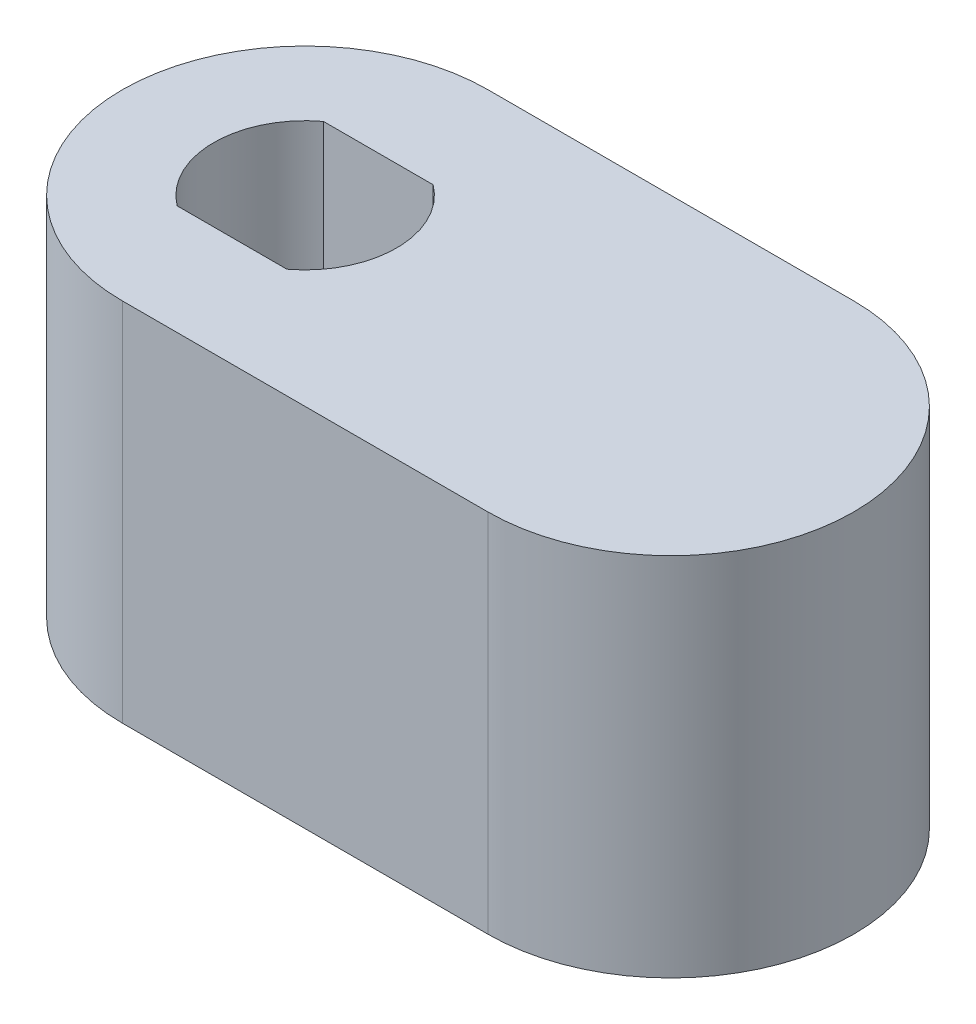
ISO-10303-21;
HEADER;
FILE_DESCRIPTION(('STEP AP214'),'2;1');
FILE_NAME('part.step','',(''),(''),'','','');
FILE_SCHEMA(('AUTOMOTIVE_DESIGN { 1 0 10303 214 1 1 1 1 }'));
ENDSEC;
DATA;
#1=APPLICATION_CONTEXT('core data for automotive mechanical design processes');
#2=APPLICATION_PROTOCOL_DEFINITION('international standard','automotive_design',2000,#1);
#3=PRODUCT_CONTEXT('',#1,'mechanical');
#4=PRODUCT('Part','Part','',(#3));
#5=PRODUCT_RELATED_PRODUCT_CATEGORY('part','',(#4));
#6=PRODUCT_DEFINITION_FORMATION('','',#4);
#7=PRODUCT_DEFINITION_CONTEXT('part definition',#1,'design');
#8=PRODUCT_DEFINITION('design','',#6,#7);
#9=PRODUCT_DEFINITION_SHAPE('','',#8);
#10=(LENGTH_UNIT() NAMED_UNIT(*) SI_UNIT(.MILLI.,.METRE.));
#11=(NAMED_UNIT(*) PLANE_ANGLE_UNIT() SI_UNIT($,.RADIAN.));
#12=(NAMED_UNIT(*) SI_UNIT($,.STERADIAN.) SOLID_ANGLE_UNIT());
#13=UNCERTAINTY_MEASURE_WITH_UNIT(LENGTH_MEASURE(1.E-05),#10,'distance_accuracy_value','');
#14=(GEOMETRIC_REPRESENTATION_CONTEXT(3) GLOBAL_UNCERTAINTY_ASSIGNED_CONTEXT((#13)) GLOBAL_UNIT_ASSIGNED_CONTEXT((#10,
#11,#12)) REPRESENTATION_CONTEXT('',''));
#15=CARTESIAN_POINT('',(0.,0.,0.));
#16=DIRECTION('',(0.,0.,1.));
#17=DIRECTION('',(1.,0.,0.));
#18=AXIS2_PLACEMENT_3D('',#15,#16,#17);
#19=CARTESIAN_POINT('',(0.,10.,0.));
#20=DIRECTION('',(0.,-1.,0.));
#21=DIRECTION('',(0.,0.,-1.));
#22=AXIS2_PLACEMENT_3D('',#19,#20,#21);
#23=CYLINDRICAL_SURFACE('',#22,5.);
#24=CARTESIAN_POINT('',(0.,0.,0.));
#25=DIRECTION('',(0.,1.,0.));
#26=DIRECTION('',(0.,0.,1.));
#27=AXIS2_PLACEMENT_3D('',#24,#25,#26);
#28=CIRCLE('',#27,5.);
#29=CARTESIAN_POINT('',(0.,0.,-5.));
#30=VERTEX_POINT('',#29);
#31=CARTESIAN_POINT('',(0.,0.,5.));
#32=VERTEX_POINT('',#31);
#33=EDGE_CURVE('E160',#30,#32,#28,.T.);
#34=ORIENTED_EDGE('',*,*,#33,.T.);
#35=DIRECTION('',(0.,-1.,0.));
#36=VECTOR('',#35,1.);
#37=CARTESIAN_POINT('',(0.,10.,5.));
#38=LINE('',#37,#36);
#39=CARTESIAN_POINT('',(0.,10.,5.));
#40=VERTEX_POINT('',#39);
#41=EDGE_CURVE('E11',#40,#32,#38,.T.);
#42=ORIENTED_EDGE('',*,*,#41,.F.);
#43=CARTESIAN_POINT('',(0.,10.,0.));
#44=DIRECTION('',(0.,1.,0.));
#45=DIRECTION('',(0.,0.,1.));
#46=AXIS2_PLACEMENT_3D('',#43,#44,#45);
#47=CIRCLE('',#46,5.);
#48=CARTESIAN_POINT('',(0.,10.,-5.));
#49=VERTEX_POINT('',#48);
#50=EDGE_CURVE('E166',#49,#40,#47,.T.);
#51=ORIENTED_EDGE('',*,*,#50,.F.);
#52=DIRECTION('',(0.,-1.,0.));
#53=VECTOR('',#52,1.);
#54=CARTESIAN_POINT('',(0.,10.,-5.));
#55=LINE('',#54,#53);
#56=EDGE_CURVE('E176',#49,#30,#55,.T.);
#57=ORIENTED_EDGE('',*,*,#56,.T.);
#58=EDGE_LOOP('',(#34,#42,#51,#57));
#59=FACE_BOUND('',#58,.T.);
#60=ADVANCED_FACE('F43',(#59),#23,.T.);
#61=CARTESIAN_POINT('',(0.,10.,5.));
#62=DIRECTION('',(0.,0.,-1.));
#63=DIRECTION('',(-1.,0.,0.));
#64=AXIS2_PLACEMENT_3D('',#61,#62,#63);
#65=PLANE('',#64);
#66=DIRECTION('',(1.,0.,0.));
#67=VECTOR('',#66,1.);
#68=CARTESIAN_POINT('',(0.,0.,5.));
#69=LINE('',#68,#67);
#70=CARTESIAN_POINT('',(10.,0.,5.));
#71=VERTEX_POINT('',#70);
#72=EDGE_CURVE('E180',#32,#71,#69,.T.);
#73=ORIENTED_EDGE('',*,*,#72,.T.);
#74=DIRECTION('',(0.,-1.,0.));
#75=VECTOR('',#74,1.);
#76=CARTESIAN_POINT('',(10.,10.,5.));
#77=LINE('',#76,#75);
#78=CARTESIAN_POINT('',(10.,10.,5.));
#79=VERTEX_POINT('',#78);
#80=EDGE_CURVE('E52',#79,#71,#77,.T.);
#81=ORIENTED_EDGE('',*,*,#80,.F.);
#82=DIRECTION('',(1.,0.,0.));
#83=VECTOR('',#82,1.);
#84=CARTESIAN_POINT('',(0.,10.,5.));
#85=LINE('',#84,#83);
#86=EDGE_CURVE('E96',#40,#79,#85,.T.);
#87=ORIENTED_EDGE('',*,*,#86,.F.);
#88=ORIENTED_EDGE('',*,*,#41,.T.);
#89=EDGE_LOOP('',(#73,#81,#87,#88));
#90=FACE_BOUND('',#89,.T.);
#91=ADVANCED_FACE('F216',(#90),#65,.F.);
#92=CARTESIAN_POINT('',(10.,10.,0.));
#93=DIRECTION('',(0.,-1.,0.));
#94=DIRECTION('',(0.,0.,-1.));
#95=AXIS2_PLACEMENT_3D('',#92,#93,#94);
#96=CYLINDRICAL_SURFACE('',#95,5.);
#97=CARTESIAN_POINT('',(10.,0.,0.));
#98=DIRECTION('',(0.,1.,0.));
#99=DIRECTION('',(0.,0.,1.));
#100=AXIS2_PLACEMENT_3D('',#97,#98,#99);
#101=CIRCLE('',#100,5.);
#102=CARTESIAN_POINT('',(10.,0.,-5.));
#103=VERTEX_POINT('',#102);
#104=EDGE_CURVE('E183',#71,#103,#101,.T.);
#105=ORIENTED_EDGE('',*,*,#104,.T.);
#106=DIRECTION('',(0.,-1.,0.));
#107=VECTOR('',#106,1.);
#108=CARTESIAN_POINT('',(10.,10.,-5.));
#109=LINE('',#108,#107);
#110=CARTESIAN_POINT('',(10.,10.,-5.));
#111=VERTEX_POINT('',#110);
#112=EDGE_CURVE('E190',#111,#103,#109,.T.);
#113=ORIENTED_EDGE('',*,*,#112,.F.);
#114=CARTESIAN_POINT('',(10.,10.,0.));
#115=DIRECTION('',(0.,1.,0.));
#116=DIRECTION('',(0.,0.,1.));
#117=AXIS2_PLACEMENT_3D('',#114,#115,#116);
#118=CIRCLE('',#117,5.);
#119=EDGE_CURVE('E171',#79,#111,#118,.T.);
#120=ORIENTED_EDGE('',*,*,#119,.F.);
#121=ORIENTED_EDGE('',*,*,#80,.T.);
#122=EDGE_LOOP('',(#105,#113,#120,#121));
#123=FACE_BOUND('',#122,.T.);
#124=ADVANCED_FACE('F198',(#123),#96,.T.);
#125=CARTESIAN_POINT('',(0.,10.,-5.));
#126=DIRECTION('',(0.,0.,1.));
#127=DIRECTION('',(1.,0.,0.));
#128=AXIS2_PLACEMENT_3D('',#125,#126,#127);
#129=PLANE('',#128);
#130=DIRECTION('',(-1.,0.,0.));
#131=VECTOR('',#130,1.);
#132=CARTESIAN_POINT('',(0.,0.,-5.));
#133=LINE('',#132,#131);
#134=EDGE_CURVE('E89',#103,#30,#133,.T.);
#135=ORIENTED_EDGE('',*,*,#134,.T.);
#136=ORIENTED_EDGE('',*,*,#56,.F.);
#137=DIRECTION('',(-1.,0.,0.));
#138=VECTOR('',#137,1.);
#139=CARTESIAN_POINT('',(0.,10.,-5.));
#140=LINE('',#139,#138);
#141=EDGE_CURVE('E68',#111,#49,#140,.T.);
#142=ORIENTED_EDGE('',*,*,#141,.F.);
#143=ORIENTED_EDGE('',*,*,#112,.T.);
#144=EDGE_LOOP('',(#135,#136,#142,#143));
#145=FACE_BOUND('',#144,.T.);
#146=ADVANCED_FACE('F206',(#145),#129,.F.);
#147=CARTESIAN_POINT('',(0.,10.,0.));
#148=DIRECTION('',(0.,1.,0.));
#149=DIRECTION('',(0.,0.,1.));
#150=AXIS2_PLACEMENT_3D('',#147,#148,#149);
#151=PLANE('',#150);
#152=CARTESIAN_POINT('',(0.,10.,0.));
#153=DIRECTION('',(0.,1.,0.));
#154=DIRECTION('',(0.,0.,1.));
#155=AXIS2_PLACEMENT_3D('',#152,#153,#154);
#156=CIRCLE('',#155,2.5);
#157=CARTESIAN_POINT('',(1.5,10.,2.));
#158=VERTEX_POINT('',#157);
#159=CARTESIAN_POINT('',(1.5,10.,-2.));
#160=VERTEX_POINT('',#159);
#161=EDGE_CURVE('E59',#158,#160,#156,.T.);
#162=ORIENTED_EDGE('',*,*,#161,.F.);
#163=DIRECTION('',(1.,0.,0.));
#164=VECTOR('',#163,1.);
#165=CARTESIAN_POINT('',(0.,10.,2.));
#166=LINE('',#165,#164);
#167=CARTESIAN_POINT('',(-1.5,10.,2.));
#168=VERTEX_POINT('',#167);
#169=EDGE_CURVE('E141',#168,#158,#166,.T.);
#170=ORIENTED_EDGE('',*,*,#169,.F.);
#171=CARTESIAN_POINT('',(-1.5,10.,-2.));
#172=VERTEX_POINT('',#171);
#173=EDGE_CURVE('E145',#172,#168,#156,.T.);
#174=ORIENTED_EDGE('',*,*,#173,.F.);
#175=DIRECTION('',(1.,0.,0.));
#176=VECTOR('',#175,1.);
#177=CARTESIAN_POINT('',(0.,10.,-2.));
#178=LINE('',#177,#176);
#179=EDGE_CURVE('E154',#172,#160,#178,.T.);
#180=ORIENTED_EDGE('',*,*,#179,.T.);
#181=EDGE_LOOP('',(#162,#170,#174,#180));
#182=FACE_BOUND('',#181,.T.);
#183=ORIENTED_EDGE('',*,*,#50,.T.);
#184=ORIENTED_EDGE('',*,*,#86,.T.);
#185=ORIENTED_EDGE('',*,*,#119,.T.);
#186=ORIENTED_EDGE('',*,*,#141,.T.);
#187=EDGE_LOOP('',(#183,#184,#185,#186));
#188=FACE_BOUND('',#187,.T.);
#189=ADVANCED_FACE('F208',(#182,#188),#151,.T.);
#190=CARTESIAN_POINT('',(0.,0.,0.));
#191=DIRECTION('',(0.,1.,0.));
#192=DIRECTION('',(0.,0.,1.));
#193=AXIS2_PLACEMENT_3D('',#190,#191,#192);
#194=PLANE('',#193);
#195=CARTESIAN_POINT('',(10.,0.,0.));
#196=DIRECTION('',(0.,-1.,0.));
#197=DIRECTION('',(0.,0.,-1.));
#198=AXIS2_PLACEMENT_3D('',#195,#196,#197);
#199=CIRCLE('',#198,2.07500000000001);
#200=CARTESIAN_POINT('',(10.,0.,-2.07500000000001));
#201=VERTEX_POINT('',#200);
#202=EDGE_CURVE('E342',#201,#201,#199,.T.);
#203=ORIENTED_EDGE('',*,*,#202,.F.);
#204=EDGE_LOOP('',(#203));
#205=FACE_BOUND('',#204,.T.);
#206=CARTESIAN_POINT('',(0.,0.,0.));
#207=DIRECTION('',(0.,-1.,0.));
#208=DIRECTION('',(0.,0.,-1.));
#209=AXIS2_PLACEMENT_3D('',#206,#207,#208);
#210=CIRCLE('',#209,3.36);
#211=CARTESIAN_POINT('',(0.,0.,-3.36));
#212=VERTEX_POINT('',#211);
#213=EDGE_CURVE('E346',#212,#212,#210,.T.);
#214=ORIENTED_EDGE('',*,*,#213,.F.);
#215=EDGE_LOOP('',(#214));
#216=FACE_BOUND('',#215,.T.);
#217=ORIENTED_EDGE('',*,*,#33,.F.);
#218=ORIENTED_EDGE('',*,*,#134,.F.);
#219=ORIENTED_EDGE('',*,*,#104,.F.);
#220=ORIENTED_EDGE('',*,*,#72,.F.);
#221=EDGE_LOOP('',(#217,#218,#219,#220));
#222=FACE_BOUND('',#221,.T.);
#223=ADVANCED_FACE('F202',(#205,#216,#222),#194,.F.);
#224=CARTESIAN_POINT('',(0.,6.,0.));
#225=DIRECTION('',(0.,1.,0.));
#226=DIRECTION('',(0.,0.,1.));
#227=AXIS2_PLACEMENT_3D('',#224,#225,#226);
#228=CYLINDRICAL_SURFACE('',#227,2.5);
#229=ORIENTED_EDGE('',*,*,#161,.T.);
#230=DIRECTION('',(0.,1.,0.));
#231=VECTOR('',#230,1.);
#232=CARTESIAN_POINT('',(1.5,6.,-2.));
#233=LINE('',#232,#231);
#234=CARTESIAN_POINT('',(1.5,6.,-2.));
#235=VERTEX_POINT('',#234);
#236=EDGE_CURVE('E121',#235,#160,#233,.T.);
#237=ORIENTED_EDGE('',*,*,#236,.F.);
#238=CARTESIAN_POINT('',(0.,6.,0.));
#239=DIRECTION('',(0.,1.,0.));
#240=DIRECTION('',(0.,0.,1.));
#241=AXIS2_PLACEMENT_3D('',#238,#239,#240);
#242=CIRCLE('',#241,2.5);
#243=CARTESIAN_POINT('',(1.5,6.,2.));
#244=VERTEX_POINT('',#243);
#245=EDGE_CURVE('E130',#244,#235,#242,.T.);
#246=ORIENTED_EDGE('',*,*,#245,.F.);
#247=DIRECTION('',(0.,1.,0.));
#248=VECTOR('',#247,1.);
#249=CARTESIAN_POINT('',(1.5,6.,2.));
#250=LINE('',#249,#248);
#251=EDGE_CURVE('E157',#244,#158,#250,.T.);
#252=ORIENTED_EDGE('',*,*,#251,.T.);
#253=EDGE_LOOP('',(#229,#237,#246,#252));
#254=FACE_BOUND('',#253,.T.);
#255=ADVANCED_FACE('F133',(#254),#228,.F.);
#256=CARTESIAN_POINT('',(0.,6.,2.));
#257=DIRECTION('',(0.,0.,1.));
#258=DIRECTION('',(1.,0.,0.));
#259=AXIS2_PLACEMENT_3D('',#256,#257,#258);
#260=PLANE('',#259);
#261=ORIENTED_EDGE('',*,*,#169,.T.);
#262=ORIENTED_EDGE('',*,*,#251,.F.);
#263=DIRECTION('',(1.,0.,0.));
#264=VECTOR('',#263,1.);
#265=CARTESIAN_POINT('',(0.,6.,2.));
#266=LINE('',#265,#264);
#267=CARTESIAN_POINT('',(-1.5,6.,2.));
#268=VERTEX_POINT('',#267);
#269=EDGE_CURVE('E136',#268,#244,#266,.T.);
#270=ORIENTED_EDGE('',*,*,#269,.F.);
#271=DIRECTION('',(0.,1.,0.));
#272=VECTOR('',#271,1.);
#273=CARTESIAN_POINT('',(-1.5,6.,2.));
#274=LINE('',#273,#272);
#275=EDGE_CURVE('E161',#268,#168,#274,.T.);
#276=ORIENTED_EDGE('',*,*,#275,.T.);
#277=EDGE_LOOP('',(#261,#262,#270,#276));
#278=FACE_BOUND('',#277,.T.);
#279=ADVANCED_FACE('F250',(#278),#260,.F.);
#280=ORIENTED_EDGE('',*,*,#173,.T.);
#281=ORIENTED_EDGE('',*,*,#275,.F.);
#282=CARTESIAN_POINT('',(-1.5,6.,-2.));
#283=VERTEX_POINT('',#282);
#284=EDGE_CURVE('E129',#283,#268,#242,.T.);
#285=ORIENTED_EDGE('',*,*,#284,.F.);
#286=DIRECTION('',(0.,1.,0.));
#287=VECTOR('',#286,1.);
#288=CARTESIAN_POINT('',(-1.5,6.,-2.));
#289=LINE('',#288,#287);
#290=EDGE_CURVE('E123',#283,#172,#289,.T.);
#291=ORIENTED_EDGE('',*,*,#290,.T.);
#292=EDGE_LOOP('',(#280,#281,#285,#291));
#293=FACE_BOUND('',#292,.T.);
#294=ADVANCED_FACE('F252',(#293),#228,.F.);
#295=CARTESIAN_POINT('',(0.,6.,-2.));
#296=DIRECTION('',(0.,0.,1.));
#297=DIRECTION('',(1.,0.,0.));
#298=AXIS2_PLACEMENT_3D('',#295,#296,#297);
#299=PLANE('',#298);
#300=ORIENTED_EDGE('',*,*,#179,.F.);
#301=ORIENTED_EDGE('',*,*,#290,.F.);
#302=DIRECTION('',(1.,0.,0.));
#303=VECTOR('',#302,1.);
#304=CARTESIAN_POINT('',(0.,6.,-2.));
#305=LINE('',#304,#303);
#306=EDGE_CURVE('E118',#283,#235,#305,.T.);
#307=ORIENTED_EDGE('',*,*,#306,.T.);
#308=ORIENTED_EDGE('',*,*,#236,.T.);
#309=EDGE_LOOP('',(#300,#301,#307,#308));
#310=FACE_BOUND('',#309,.T.);
#311=ADVANCED_FACE('F120',(#310),#299,.T.);
#312=CARTESIAN_POINT('',(0.,6.,0.));
#313=DIRECTION('',(0.,1.,0.));
#314=DIRECTION('',(0.,0.,1.));
#315=AXIS2_PLACEMENT_3D('',#312,#313,#314);
#316=PLANE('',#315);
#317=CARTESIAN_POINT('',(0.,6.,0.));
#318=DIRECTION('',(0.,1.,0.));
#319=DIRECTION('',(0.,0.,1.));
#320=AXIS2_PLACEMENT_3D('',#317,#318,#319);
#321=CIRCLE('',#320,1.7);
#322=CARTESIAN_POINT('',(0.,6.,1.7));
#323=VERTEX_POINT('',#322);
#324=EDGE_CURVE('E46',#323,#323,#321,.T.);
#325=ORIENTED_EDGE('',*,*,#324,.F.);
#326=EDGE_LOOP('',(#325));
#327=FACE_BOUND('',#326,.T.);
#328=ORIENTED_EDGE('',*,*,#245,.T.);
#329=ORIENTED_EDGE('',*,*,#306,.F.);
#330=ORIENTED_EDGE('',*,*,#284,.T.);
#331=ORIENTED_EDGE('',*,*,#269,.T.);
#332=EDGE_LOOP('',(#328,#329,#330,#331));
#333=FACE_BOUND('',#332,.T.);
#334=ADVANCED_FACE('F138',(#327,#333),#316,.T.);
#335=CARTESIAN_POINT('',(0.,0.,0.));
#336=DIRECTION('',(0.,-1.,0.));
#337=DIRECTION('',(0.,0.,-1.));
#338=AXIS2_PLACEMENT_3D('',#335,#336,#337);
#339=CYLINDRICAL_SURFACE('',#338,1.7);
#340=ORIENTED_EDGE('',*,*,#324,.T.);
#341=EDGE_LOOP('',(#340));
#342=FACE_BOUND('',#341,.T.);
#343=CARTESIAN_POINT('',(0.,1.66,0.));
#344=DIRECTION('',(0.,-1.,0.));
#345=DIRECTION('',(0.,0.,-1.));
#346=AXIS2_PLACEMENT_3D('',#343,#344,#345);
#347=CIRCLE('',#346,1.7);
#348=CARTESIAN_POINT('',(0.,1.66,-1.7));
#349=VERTEX_POINT('',#348);
#350=EDGE_CURVE('E351',#349,#349,#347,.T.);
#351=ORIENTED_EDGE('',*,*,#350,.T.);
#352=EDGE_LOOP('',(#351));
#353=FACE_BOUND('',#352,.T.);
#354=ADVANCED_FACE('F286',(#342,#353),#339,.F.);
#355=CARTESIAN_POINT('',(0.,0.,0.));
#356=DIRECTION('',(0.,-1.,0.));
#357=DIRECTION('',(0.,0.,-1.));
#358=AXIS2_PLACEMENT_3D('',#355,#356,#357);
#359=CONICAL_SURFACE('',#358,3.36,0.785398163397448);
#360=ORIENTED_EDGE('',*,*,#350,.F.);
#361=EDGE_LOOP('',(#360));
#362=FACE_BOUND('',#361,.T.);
#363=ORIENTED_EDGE('',*,*,#213,.T.);
#364=EDGE_LOOP('',(#363));
#365=FACE_BOUND('',#364,.T.);
#366=ADVANCED_FACE('F296',(#362,#365),#359,.F.);
#367=CARTESIAN_POINT('',(10.,7.50000000000001,0.));
#368=DIRECTION('',(0.,1.,0.));
#369=DIRECTION('',(0.,0.,1.));
#370=AXIS2_PLACEMENT_3D('',#367,#368,#369);
#371=PLANE('',#370);
#372=CARTESIAN_POINT('',(10.,7.50000000000001,0.));
#373=DIRECTION('',(0.,-1.,0.));
#374=DIRECTION('',(0.,0.,-1.));
#375=AXIS2_PLACEMENT_3D('',#372,#373,#374);
#376=CIRCLE('',#375,2.07500000000001);
#377=CARTESIAN_POINT('',(10.,7.50000000000001,-2.07500000000001));
#378=VERTEX_POINT('',#377);
#379=EDGE_CURVE('E339',#378,#378,#376,.T.);
#380=ORIENTED_EDGE('',*,*,#379,.T.);
#381=EDGE_LOOP('',(#380));
#382=FACE_BOUND('',#381,.T.);
#383=ADVANCED_FACE('F306',(#382),#371,.F.);
#384=CARTESIAN_POINT('',(10.,0.,0.));
#385=DIRECTION('',(0.,-1.,0.));
#386=DIRECTION('',(0.,0.,-1.));
#387=AXIS2_PLACEMENT_3D('',#384,#385,#386);
#388=CYLINDRICAL_SURFACE('',#387,2.07500000000001);
#389=ORIENTED_EDGE('',*,*,#379,.F.);
#390=EDGE_LOOP('',(#389));
#391=FACE_BOUND('',#390,.T.);
#392=ORIENTED_EDGE('',*,*,#202,.T.);
#393=EDGE_LOOP('',(#392));
#394=FACE_BOUND('',#393,.T.);
#395=ADVANCED_FACE('F322',(#391,#394),#388,.F.);
#396=CLOSED_SHELL('',(#60,#91,#124,#146,#189,#223,#255,#279,#294,#311,#334,#354,#366,#383,#395));
#397=MANIFOLD_SOLID_BREP('B2',#396);
#398=ADVANCED_BREP_SHAPE_REPRESENTATION('',(#18,#397),#14);
#399=SHAPE_DEFINITION_REPRESENTATION(#9,#398);
ENDSEC;
END-ISO-10303-21;
